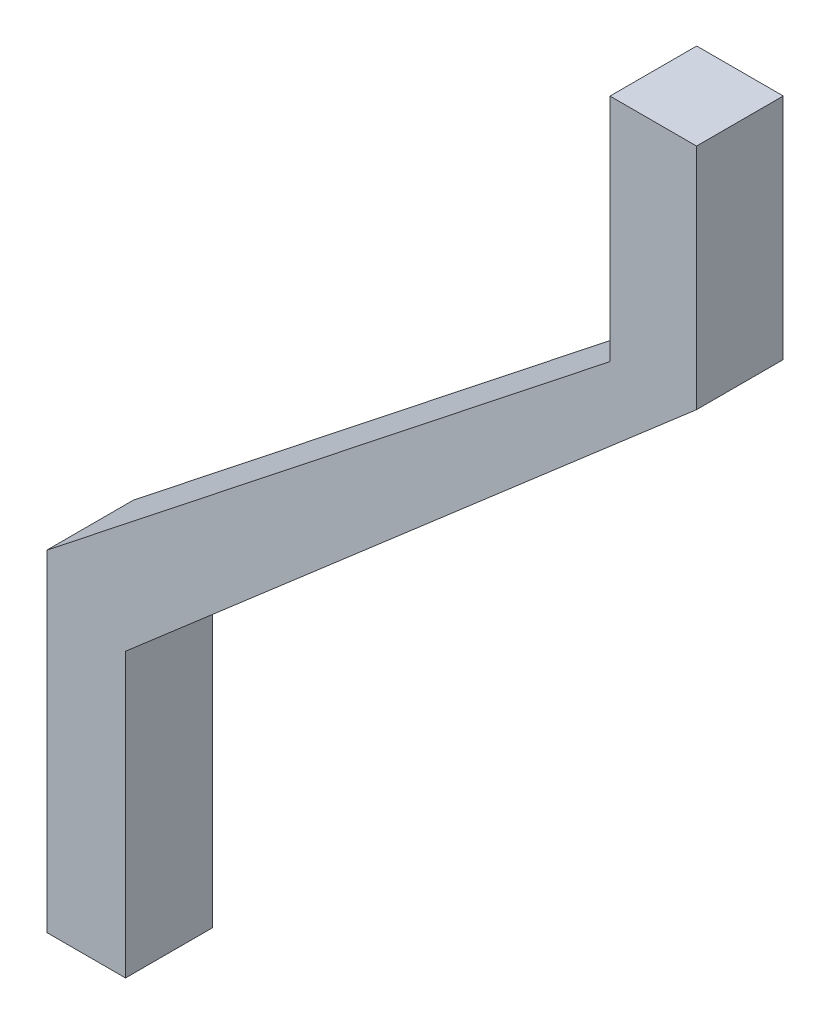
ISO-10303-21;
HEADER;
FILE_DESCRIPTION(('STEP AP214'),'2;1');
FILE_NAME('part.step','',(''),(''),'','','');
FILE_SCHEMA(('AUTOMOTIVE_DESIGN { 1 0 10303 214 1 1 1 1 }'));
ENDSEC;
DATA;
#1=APPLICATION_CONTEXT('core data for automotive mechanical design processes');
#2=APPLICATION_PROTOCOL_DEFINITION('international standard','automotive_design',2000,#1);
#3=PRODUCT_CONTEXT('',#1,'mechanical');
#4=PRODUCT('Part','Part','',(#3));
#5=PRODUCT_RELATED_PRODUCT_CATEGORY('part','',(#4));
#6=PRODUCT_DEFINITION_FORMATION('','',#4);
#7=PRODUCT_DEFINITION_CONTEXT('part definition',#1,'design');
#8=PRODUCT_DEFINITION('design','',#6,#7);
#9=PRODUCT_DEFINITION_SHAPE('','',#8);
#10=(LENGTH_UNIT() NAMED_UNIT(*) SI_UNIT(.MILLI.,.METRE.));
#11=(NAMED_UNIT(*) PLANE_ANGLE_UNIT() SI_UNIT($,.RADIAN.));
#12=(NAMED_UNIT(*) SI_UNIT($,.STERADIAN.) SOLID_ANGLE_UNIT());
#13=UNCERTAINTY_MEASURE_WITH_UNIT(LENGTH_MEASURE(1.E-05),#10,'distance_accuracy_value','');
#14=(GEOMETRIC_REPRESENTATION_CONTEXT(3) GLOBAL_UNCERTAINTY_ASSIGNED_CONTEXT((#13)) GLOBAL_UNIT_ASSIGNED_CONTEXT((#10,
#11,#12)) REPRESENTATION_CONTEXT('',''));
#15=CARTESIAN_POINT('',(0.,0.,0.));
#16=DIRECTION('',(0.,0.,1.));
#17=DIRECTION('',(1.,0.,0.));
#18=AXIS2_PLACEMENT_3D('',#15,#16,#17);
#19=CARTESIAN_POINT('',(0.,0.,10.));
#20=DIRECTION('',(0.,-1.,0.));
#21=DIRECTION('',(0.,0.,-1.));
#22=AXIS2_PLACEMENT_3D('',#19,#20,#21);
#23=PLANE('',#22);
#24=DIRECTION('',(-1.,0.,0.));
#25=VECTOR('',#24,1.);
#26=CARTESIAN_POINT('',(0.,0.,0.));
#27=LINE('',#26,#25);
#28=CARTESIAN_POINT('',(9.98058843662958,0.,0.));
#29=VERTEX_POINT('',#28);
#30=CARTESIAN_POINT('',(0.,0.,0.));
#31=VERTEX_POINT('',#30);
#32=EDGE_CURVE('E135',#29,#31,#27,.T.);
#33=ORIENTED_EDGE('',*,*,#32,.T.);
#34=DIRECTION('',(0.,0.,-1.));
#35=VECTOR('',#34,1.);
#36=CARTESIAN_POINT('',(0.,0.,10.));
#37=LINE('',#36,#35);
#38=CARTESIAN_POINT('',(0.,0.,10.));
#39=VERTEX_POINT('',#38);
#40=EDGE_CURVE('E11',#39,#31,#37,.T.);
#41=ORIENTED_EDGE('',*,*,#40,.F.);
#42=DIRECTION('',(-1.,0.,0.));
#43=VECTOR('',#42,1.);
#44=CARTESIAN_POINT('',(0.,0.,10.));
#45=LINE('',#44,#43);
#46=CARTESIAN_POINT('',(9.98058843662958,0.,10.));
#47=VERTEX_POINT('',#46);
#48=EDGE_CURVE('E149',#47,#39,#45,.T.);
#49=ORIENTED_EDGE('',*,*,#48,.F.);
#50=DIRECTION('',(0.,0.,-1.));
#51=VECTOR('',#50,1.);
#52=CARTESIAN_POINT('',(9.98058843662958,0.,10.));
#53=LINE('',#52,#51);
#54=EDGE_CURVE('E131',#47,#29,#53,.T.);
#55=ORIENTED_EDGE('',*,*,#54,.T.);
#56=EDGE_LOOP('',(#33,#41,#49,#55));
#57=FACE_BOUND('',#56,.T.);
#58=ADVANCED_FACE('F39',(#57),#23,.F.);
#59=CARTESIAN_POINT('',(0.,0.,10.));
#60=DIRECTION('',(1.,0.,0.));
#61=DIRECTION('',(0.,0.,-1.));
#62=AXIS2_PLACEMENT_3D('',#59,#60,#61);
#63=PLANE('',#62);
#64=DIRECTION('',(0.,-1.,0.));
#65=VECTOR('',#64,1.);
#66=CARTESIAN_POINT('',(0.,0.,0.));
#67=LINE('',#66,#65);
#68=CARTESIAN_POINT('',(0.,-26.5205882352941,0.));
#69=VERTEX_POINT('',#68);
#70=EDGE_CURVE('E138',#31,#69,#67,.T.);
#71=ORIENTED_EDGE('',*,*,#70,.T.);
#72=DIRECTION('',(0.,0.,-1.));
#73=VECTOR('',#72,1.);
#74=CARTESIAN_POINT('',(0.,-26.5205882352941,10.));
#75=LINE('',#74,#73);
#76=CARTESIAN_POINT('',(0.,-26.5205882352941,10.));
#77=VERTEX_POINT('',#76);
#78=EDGE_CURVE('E47',#77,#69,#75,.T.);
#79=ORIENTED_EDGE('',*,*,#78,.F.);
#80=DIRECTION('',(0.,-1.,0.));
#81=VECTOR('',#80,1.);
#82=CARTESIAN_POINT('',(0.,0.,10.));
#83=LINE('',#82,#81);
#84=EDGE_CURVE('E98',#39,#77,#83,.T.);
#85=ORIENTED_EDGE('',*,*,#84,.F.);
#86=ORIENTED_EDGE('',*,*,#40,.T.);
#87=EDGE_LOOP('',(#71,#79,#85,#86));
#88=FACE_BOUND('',#87,.T.);
#89=ADVANCED_FACE('F184',(#88),#63,.F.);
#90=CARTESIAN_POINT('',(0.,-26.5205882352941,10.));
#91=DIRECTION('',(0.619828510016627,-0.784737292455614,0.));
#92=DIRECTION('',(0.784737292455615,0.619828510016627,0.));
#93=AXIS2_PLACEMENT_3D('',#90,#91,#92);
#94=PLANE('',#93);
#95=DIRECTION('',(-0.784737292455614,-0.619828510016626,0.));
#96=VECTOR('',#95,1.);
#97=CARTESIAN_POINT('',(0.,-26.5205882352941,0.));
#98=LINE('',#97,#96);
#99=CARTESIAN_POINT('',(-64.9461645468999,-77.8186274509804,0.));
#100=VERTEX_POINT('',#99);
#101=EDGE_CURVE('E140',#69,#100,#98,.T.);
#102=ORIENTED_EDGE('',*,*,#101,.T.);
#103=DIRECTION('',(0.,0.,-1.));
#104=VECTOR('',#103,1.);
#105=CARTESIAN_POINT('',(-64.9461645468999,-77.8186274509804,10.));
#106=LINE('',#105,#104);
#107=CARTESIAN_POINT('',(-64.9461645468999,-77.8186274509804,10.));
#108=VERTEX_POINT('',#107);
#109=EDGE_CURVE('E156',#108,#100,#106,.T.);
#110=ORIENTED_EDGE('',*,*,#109,.F.);
#111=DIRECTION('',(-0.784737292455614,-0.619828510016626,0.));
#112=VECTOR('',#111,1.);
#113=CARTESIAN_POINT('',(0.,-26.5205882352941,10.));
#114=LINE('',#113,#112);
#115=EDGE_CURVE('E164',#77,#108,#114,.T.);
#116=ORIENTED_EDGE('',*,*,#115,.F.);
#117=ORIENTED_EDGE('',*,*,#78,.T.);
#118=EDGE_LOOP('',(#102,#110,#116,#117));
#119=FACE_BOUND('',#118,.T.);
#120=ADVANCED_FACE('F162',(#119),#94,.F.);
#121=CARTESIAN_POINT('',(-64.9461645468999,-77.8186274509804,10.));
#122=DIRECTION('',(1.,0.,0.));
#123=DIRECTION('',(0.,0.,-1.));
#124=AXIS2_PLACEMENT_3D('',#121,#122,#123);
#125=PLANE('',#124);
#126=DIRECTION('',(0.,-1.,0.));
#127=VECTOR('',#126,1.);
#128=CARTESIAN_POINT('',(-64.9461645468999,-77.8186274509804,0.));
#129=LINE('',#128,#127);
#130=CARTESIAN_POINT('',(-64.9461645468999,-116.003294117647,0.));
#131=VERTEX_POINT('',#130);
#132=EDGE_CURVE('E142',#100,#131,#129,.T.);
#133=ORIENTED_EDGE('',*,*,#132,.T.);
#134=DIRECTION('',(0.,0.,-1.));
#135=VECTOR('',#134,1.);
#136=CARTESIAN_POINT('',(-64.9461645468999,-116.003294117647,10.));
#137=LINE('',#136,#135);
#138=CARTESIAN_POINT('',(-64.9461645468999,-116.003294117647,10.));
#139=VERTEX_POINT('',#138);
#140=EDGE_CURVE('E153',#139,#131,#137,.T.);
#141=ORIENTED_EDGE('',*,*,#140,.F.);
#142=DIRECTION('',(0.,-1.,0.));
#143=VECTOR('',#142,1.);
#144=CARTESIAN_POINT('',(-64.9461645468999,-77.8186274509804,10.));
#145=LINE('',#144,#143);
#146=EDGE_CURVE('E176',#108,#139,#145,.T.);
#147=ORIENTED_EDGE('',*,*,#146,.F.);
#148=ORIENTED_EDGE('',*,*,#109,.T.);
#149=EDGE_LOOP('',(#133,#141,#147,#148));
#150=FACE_BOUND('',#149,.T.);
#151=ADVANCED_FACE('F172',(#150),#125,.F.);
#152=CARTESIAN_POINT('',(-64.9461645468999,-116.003294117647,10.));
#153=DIRECTION('',(0.,1.,0.));
#154=DIRECTION('',(0.,0.,1.));
#155=AXIS2_PLACEMENT_3D('',#152,#153,#154);
#156=PLANE('',#155);
#157=DIRECTION('',(1.,0.,0.));
#158=VECTOR('',#157,1.);
#159=CARTESIAN_POINT('',(-64.9461645468999,-116.003294117647,0.));
#160=LINE('',#159,#158);
#161=CARTESIAN_POINT('',(-55.8619292527822,-116.003294117647,0.));
#162=VERTEX_POINT('',#161);
#163=EDGE_CURVE('E144',#131,#162,#160,.T.);
#164=ORIENTED_EDGE('',*,*,#163,.T.);
#165=DIRECTION('',(0.,0.,-1.));
#166=VECTOR('',#165,1.);
#167=CARTESIAN_POINT('',(-55.8619292527822,-116.003294117647,10.));
#168=LINE('',#167,#166);
#169=CARTESIAN_POINT('',(-55.8619292527822,-116.003294117647,10.));
#170=VERTEX_POINT('',#169);
#171=EDGE_CURVE('E126',#170,#162,#168,.T.);
#172=ORIENTED_EDGE('',*,*,#171,.F.);
#173=DIRECTION('',(1.,0.,0.));
#174=VECTOR('',#173,1.);
#175=CARTESIAN_POINT('',(-64.9461645468999,-116.003294117647,10.));
#176=LINE('',#175,#174);
#177=EDGE_CURVE('E117',#139,#170,#176,.T.);
#178=ORIENTED_EDGE('',*,*,#177,.F.);
#179=ORIENTED_EDGE('',*,*,#140,.T.);
#180=EDGE_LOOP('',(#164,#172,#178,#179));
#181=FACE_BOUND('',#180,.T.);
#182=ADVANCED_FACE('F175',(#181),#156,.F.);
#183=CARTESIAN_POINT('',(-55.8619292527822,-116.003294117647,10.));
#184=DIRECTION('',(-1.,0.,0.));
#185=DIRECTION('',(0.,0.,1.));
#186=AXIS2_PLACEMENT_3D('',#183,#184,#185);
#187=PLANE('',#186);
#188=DIRECTION('',(0.,1.,0.));
#189=VECTOR('',#188,1.);
#190=CARTESIAN_POINT('',(-55.8619292527822,-116.003294117647,0.));
#191=LINE('',#190,#189);
#192=CARTESIAN_POINT('',(-55.8619292527822,-83.3717647058823,0.));
#193=VERTEX_POINT('',#192);
#194=EDGE_CURVE('E125',#162,#193,#191,.T.);
#195=ORIENTED_EDGE('',*,*,#194,.T.);
#196=DIRECTION('',(0.,0.,-1.));
#197=VECTOR('',#196,1.);
#198=CARTESIAN_POINT('',(-55.8619292527822,-83.3717647058823,10.));
#199=LINE('',#198,#197);
#200=CARTESIAN_POINT('',(-55.8619292527822,-83.3717647058823,10.));
#201=VERTEX_POINT('',#200);
#202=EDGE_CURVE('E122',#201,#193,#199,.T.);
#203=ORIENTED_EDGE('',*,*,#202,.F.);
#204=DIRECTION('',(0.,1.,0.));
#205=VECTOR('',#204,1.);
#206=CARTESIAN_POINT('',(-55.8619292527822,-116.003294117647,10.));
#207=LINE('',#206,#205);
#208=EDGE_CURVE('E111',#170,#201,#207,.T.);
#209=ORIENTED_EDGE('',*,*,#208,.F.);
#210=ORIENTED_EDGE('',*,*,#171,.T.);
#211=EDGE_LOOP('',(#195,#203,#209,#210));
#212=FACE_BOUND('',#211,.T.);
#213=ADVANCED_FACE('F123',(#212),#187,.F.);
#214=CARTESIAN_POINT('',(-55.8619292527822,-83.3717647058823,10.));
#215=DIRECTION('',(-0.654792944915933,0.755808308559994,0.));
#216=DIRECTION('',(-0.755808308559994,-0.654792944915933,0.));
#217=AXIS2_PLACEMENT_3D('',#214,#215,#216);
#218=PLANE('',#217);
#219=DIRECTION('',(0.755808308559994,0.654792944915933,0.));
#220=VECTOR('',#219,1.);
#221=CARTESIAN_POINT('',(-55.8619292527822,-83.3717647058823,0.));
#222=LINE('',#221,#220);
#223=CARTESIAN_POINT('',(9.98058843662958,-26.3292374271456,0.));
#224=VERTEX_POINT('',#223);
#225=EDGE_CURVE('E84',#193,#224,#222,.T.);
#226=ORIENTED_EDGE('',*,*,#225,.T.);
#227=DIRECTION('',(0.,0.,-1.));
#228=VECTOR('',#227,1.);
#229=CARTESIAN_POINT('',(9.98058843662958,-26.3292374271456,10.));
#230=LINE('',#229,#228);
#231=CARTESIAN_POINT('',(9.98058843662958,-26.3292374271456,10.));
#232=VERTEX_POINT('',#231);
#233=EDGE_CURVE('E127',#232,#224,#230,.T.);
#234=ORIENTED_EDGE('',*,*,#233,.F.);
#235=DIRECTION('',(0.755808308559994,0.654792944915933,0.));
#236=VECTOR('',#235,1.);
#237=CARTESIAN_POINT('',(-55.8619292527822,-83.3717647058823,10.));
#238=LINE('',#237,#236);
#239=EDGE_CURVE('E115',#201,#232,#238,.T.);
#240=ORIENTED_EDGE('',*,*,#239,.F.);
#241=ORIENTED_EDGE('',*,*,#202,.T.);
#242=EDGE_LOOP('',(#226,#234,#240,#241));
#243=FACE_BOUND('',#242,.T.);
#244=ADVANCED_FACE('F129',(#243),#218,.F.);
#245=CARTESIAN_POINT('',(9.98058843662958,-26.3292374271456,10.));
#246=DIRECTION('',(-1.,0.,0.));
#247=DIRECTION('',(0.,0.,1.));
#248=AXIS2_PLACEMENT_3D('',#245,#246,#247);
#249=PLANE('',#248);
#250=DIRECTION('',(0.,1.,0.));
#251=VECTOR('',#250,1.);
#252=CARTESIAN_POINT('',(9.98058843662958,-26.3292374271456,0.));
#253=LINE('',#252,#251);
#254=EDGE_CURVE('E90',#224,#29,#253,.T.);
#255=ORIENTED_EDGE('',*,*,#254,.T.);
#256=ORIENTED_EDGE('',*,*,#54,.F.);
#257=DIRECTION('',(0.,1.,0.));
#258=VECTOR('',#257,1.);
#259=CARTESIAN_POINT('',(9.98058843662958,-26.3292374271456,10.));
#260=LINE('',#259,#258);
#261=EDGE_CURVE('E55',#232,#47,#260,.T.);
#262=ORIENTED_EDGE('',*,*,#261,.F.);
#263=ORIENTED_EDGE('',*,*,#233,.T.);
#264=EDGE_LOOP('',(#255,#256,#262,#263));
#265=FACE_BOUND('',#264,.T.);
#266=ADVANCED_FACE('F200',(#265),#249,.F.);
#267=CARTESIAN_POINT('',(0.,0.,10.));
#268=DIRECTION('',(0.,0.,1.));
#269=DIRECTION('',(1.,0.,0.));
#270=AXIS2_PLACEMENT_3D('',#267,#268,#269);
#271=PLANE('',#270);
#272=ORIENTED_EDGE('',*,*,#48,.T.);
#273=ORIENTED_EDGE('',*,*,#84,.T.);
#274=ORIENTED_EDGE('',*,*,#115,.T.);
#275=ORIENTED_EDGE('',*,*,#146,.T.);
#276=ORIENTED_EDGE('',*,*,#177,.T.);
#277=ORIENTED_EDGE('',*,*,#208,.T.);
#278=ORIENTED_EDGE('',*,*,#239,.T.);
#279=ORIENTED_EDGE('',*,*,#261,.T.);
#280=EDGE_LOOP('',(#272,#273,#274,#275,#276,#277,#278,#279));
#281=FACE_BOUND('',#280,.T.);
#282=ADVANCED_FACE('F113',(#281),#271,.T.);
#283=CARTESIAN_POINT('',(0.,0.,0.));
#284=DIRECTION('',(0.,0.,1.));
#285=DIRECTION('',(1.,0.,0.));
#286=AXIS2_PLACEMENT_3D('',#283,#284,#285);
#287=PLANE('',#286);
#288=ORIENTED_EDGE('',*,*,#32,.F.);
#289=ORIENTED_EDGE('',*,*,#254,.F.);
#290=ORIENTED_EDGE('',*,*,#225,.F.);
#291=ORIENTED_EDGE('',*,*,#194,.F.);
#292=ORIENTED_EDGE('',*,*,#163,.F.);
#293=ORIENTED_EDGE('',*,*,#132,.F.);
#294=ORIENTED_EDGE('',*,*,#101,.F.);
#295=ORIENTED_EDGE('',*,*,#70,.F.);
#296=EDGE_LOOP('',(#288,#289,#290,#291,#292,#293,#294,#295));
#297=FACE_BOUND('',#296,.T.);
#298=ADVANCED_FACE('F168',(#297),#287,.F.);
#299=CLOSED_SHELL('',(#58,#89,#120,#151,#182,#213,#244,#266,#282,#298));
#300=MANIFOLD_SOLID_BREP('B2',#299);
#301=ADVANCED_BREP_SHAPE_REPRESENTATION('',(#18,#300),#14);
#302=SHAPE_DEFINITION_REPRESENTATION(#9,#301);
ENDSEC;
END-ISO-10303-21;
